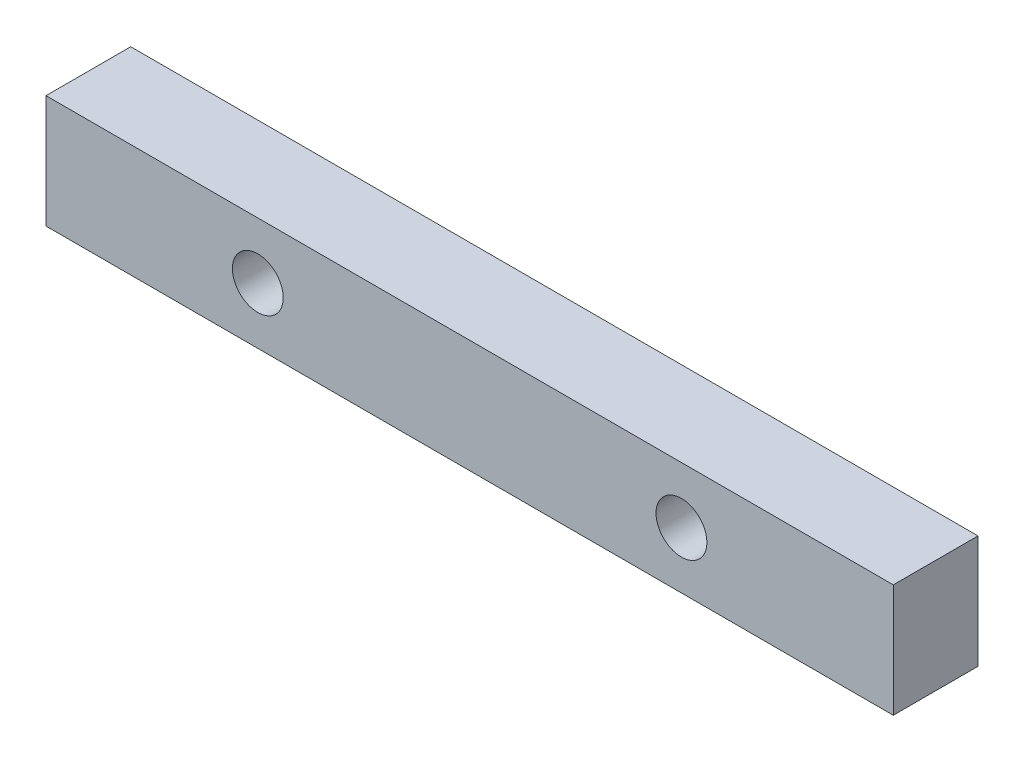
ISO-10303-21;
HEADER;
FILE_DESCRIPTION(('STEP AP214'),'2;1');
FILE_NAME('part.step','',(''),(''),'','','');
FILE_SCHEMA(('AUTOMOTIVE_DESIGN { 1 0 10303 214 1 1 1 1 }'));
ENDSEC;
DATA;
#1=APPLICATION_CONTEXT('core data for automotive mechanical design processes');
#2=APPLICATION_PROTOCOL_DEFINITION('international standard','automotive_design',2000,#1);
#3=PRODUCT_CONTEXT('',#1,'mechanical');
#4=PRODUCT('Part','Part','',(#3));
#5=PRODUCT_RELATED_PRODUCT_CATEGORY('part','',(#4));
#6=PRODUCT_DEFINITION_FORMATION('','',#4);
#7=PRODUCT_DEFINITION_CONTEXT('part definition',#1,'design');
#8=PRODUCT_DEFINITION('design','',#6,#7);
#9=PRODUCT_DEFINITION_SHAPE('','',#8);
#10=(LENGTH_UNIT() NAMED_UNIT(*) SI_UNIT(.MILLI.,.METRE.));
#11=(NAMED_UNIT(*) PLANE_ANGLE_UNIT() SI_UNIT($,.RADIAN.));
#12=(NAMED_UNIT(*) SI_UNIT($,.STERADIAN.) SOLID_ANGLE_UNIT());
#13=UNCERTAINTY_MEASURE_WITH_UNIT(LENGTH_MEASURE(1.E-05),#10,'distance_accuracy_value','');
#14=(GEOMETRIC_REPRESENTATION_CONTEXT(3) GLOBAL_UNCERTAINTY_ASSIGNED_CONTEXT((#13)) GLOBAL_UNIT_ASSIGNED_CONTEXT((#10,
#11,#12)) REPRESENTATION_CONTEXT('',''));
#15=CARTESIAN_POINT('',(0.,0.,0.));
#16=DIRECTION('',(0.,0.,1.));
#17=DIRECTION('',(1.,0.,0.));
#18=AXIS2_PLACEMENT_3D('',#15,#16,#17);
#19=CARTESIAN_POINT('',(75.,-10.,15.));
#20=DIRECTION('',(-1.,0.,0.));
#21=DIRECTION('',(0.,0.,1.));
#22=AXIS2_PLACEMENT_3D('',#19,#20,#21);
#23=PLANE('',#22);
#24=DIRECTION('',(0.,1.,0.));
#25=VECTOR('',#24,1.);
#26=CARTESIAN_POINT('',(75.,-10.,0.));
#27=LINE('',#26,#25);
#28=CARTESIAN_POINT('',(75.,-10.,0.));
#29=VERTEX_POINT('',#28);
#30=CARTESIAN_POINT('',(75.,10.,0.));
#31=VERTEX_POINT('',#30);
#32=EDGE_CURVE('E95',#29,#31,#27,.T.);
#33=ORIENTED_EDGE('',*,*,#32,.T.);
#34=DIRECTION('',(0.,0.,-1.));
#35=VECTOR('',#34,1.);
#36=CARTESIAN_POINT('',(75.,10.,15.));
#37=LINE('',#36,#35);
#38=CARTESIAN_POINT('',(75.,10.,15.));
#39=VERTEX_POINT('',#38);
#40=EDGE_CURVE('E11',#39,#31,#37,.T.);
#41=ORIENTED_EDGE('',*,*,#40,.F.);
#42=DIRECTION('',(0.,1.,0.));
#43=VECTOR('',#42,1.);
#44=CARTESIAN_POINT('',(75.,-10.,15.));
#45=LINE('',#44,#43);
#46=CARTESIAN_POINT('',(75.,-10.,15.));
#47=VERTEX_POINT('',#46);
#48=EDGE_CURVE('E83',#47,#39,#45,.T.);
#49=ORIENTED_EDGE('',*,*,#48,.F.);
#50=DIRECTION('',(0.,0.,-1.));
#51=VECTOR('',#50,1.);
#52=CARTESIAN_POINT('',(75.,-10.,15.));
#53=LINE('',#52,#51);
#54=EDGE_CURVE('E91',#47,#29,#53,.T.);
#55=ORIENTED_EDGE('',*,*,#54,.T.);
#56=EDGE_LOOP('',(#33,#41,#49,#55));
#57=FACE_BOUND('',#56,.T.);
#58=ADVANCED_FACE('F32',(#57),#23,.F.);
#59=CARTESIAN_POINT('',(-75.,10.,15.));
#60=DIRECTION('',(0.,-1.,0.));
#61=DIRECTION('',(0.,0.,-1.));
#62=AXIS2_PLACEMENT_3D('',#59,#60,#61);
#63=PLANE('',#62);
#64=DIRECTION('',(-1.,0.,0.));
#65=VECTOR('',#64,1.);
#66=CARTESIAN_POINT('',(-75.,10.,0.));
#67=LINE('',#66,#65);
#68=CARTESIAN_POINT('',(-75.,10.,0.));
#69=VERTEX_POINT('',#68);
#70=EDGE_CURVE('E87',#31,#69,#67,.T.);
#71=ORIENTED_EDGE('',*,*,#70,.T.);
#72=DIRECTION('',(0.,0.,-1.));
#73=VECTOR('',#72,1.);
#74=CARTESIAN_POINT('',(-75.,10.,15.));
#75=LINE('',#74,#73);
#76=CARTESIAN_POINT('',(-75.,10.,15.));
#77=VERTEX_POINT('',#76);
#78=EDGE_CURVE('E40',#77,#69,#75,.T.);
#79=ORIENTED_EDGE('',*,*,#78,.F.);
#80=DIRECTION('',(-1.,0.,0.));
#81=VECTOR('',#80,1.);
#82=CARTESIAN_POINT('',(-75.,10.,15.));
#83=LINE('',#82,#81);
#84=EDGE_CURVE('E78',#39,#77,#83,.T.);
#85=ORIENTED_EDGE('',*,*,#84,.F.);
#86=ORIENTED_EDGE('',*,*,#40,.T.);
#87=EDGE_LOOP('',(#71,#79,#85,#86));
#88=FACE_BOUND('',#87,.T.);
#89=ADVANCED_FACE('F86',(#88),#63,.F.);
#90=CARTESIAN_POINT('',(-75.,-10.,15.));
#91=DIRECTION('',(1.,0.,0.));
#92=DIRECTION('',(0.,0.,-1.));
#93=AXIS2_PLACEMENT_3D('',#90,#91,#92);
#94=PLANE('',#93);
#95=DIRECTION('',(0.,-1.,0.));
#96=VECTOR('',#95,1.);
#97=CARTESIAN_POINT('',(-75.,-10.,0.));
#98=LINE('',#97,#96);
#99=CARTESIAN_POINT('',(-75.,-10.,0.));
#100=VERTEX_POINT('',#99);
#101=EDGE_CURVE('E65',#69,#100,#98,.T.);
#102=ORIENTED_EDGE('',*,*,#101,.T.);
#103=DIRECTION('',(0.,0.,-1.));
#104=VECTOR('',#103,1.);
#105=CARTESIAN_POINT('',(-75.,-10.,15.));
#106=LINE('',#105,#104);
#107=CARTESIAN_POINT('',(-75.,-10.,15.));
#108=VERTEX_POINT('',#107);
#109=EDGE_CURVE('E88',#108,#100,#106,.T.);
#110=ORIENTED_EDGE('',*,*,#109,.F.);
#111=DIRECTION('',(0.,-1.,0.));
#112=VECTOR('',#111,1.);
#113=CARTESIAN_POINT('',(-75.,-10.,15.));
#114=LINE('',#113,#112);
#115=EDGE_CURVE('E81',#77,#108,#114,.T.);
#116=ORIENTED_EDGE('',*,*,#115,.F.);
#117=ORIENTED_EDGE('',*,*,#78,.T.);
#118=EDGE_LOOP('',(#102,#110,#116,#117));
#119=FACE_BOUND('',#118,.T.);
#120=ADVANCED_FACE('F89',(#119),#94,.F.);
#121=CARTESIAN_POINT('',(-75.,-10.,15.));
#122=DIRECTION('',(0.,1.,0.));
#123=DIRECTION('',(0.,0.,1.));
#124=AXIS2_PLACEMENT_3D('',#121,#122,#123);
#125=PLANE('',#124);
#126=DIRECTION('',(1.,0.,0.));
#127=VECTOR('',#126,1.);
#128=CARTESIAN_POINT('',(-75.,-10.,0.));
#129=LINE('',#128,#127);
#130=EDGE_CURVE('E71',#100,#29,#129,.T.);
#131=ORIENTED_EDGE('',*,*,#130,.T.);
#132=ORIENTED_EDGE('',*,*,#54,.F.);
#133=DIRECTION('',(1.,0.,0.));
#134=VECTOR('',#133,1.);
#135=CARTESIAN_POINT('',(-75.,-10.,15.));
#136=LINE('',#135,#134);
#137=EDGE_CURVE('E48',#108,#47,#136,.T.);
#138=ORIENTED_EDGE('',*,*,#137,.F.);
#139=ORIENTED_EDGE('',*,*,#109,.T.);
#140=EDGE_LOOP('',(#131,#132,#138,#139));
#141=FACE_BOUND('',#140,.T.);
#142=ADVANCED_FACE('F103',(#141),#125,.F.);
#143=CARTESIAN_POINT('',(0.,0.,15.));
#144=DIRECTION('',(0.,0.,-1.));
#145=DIRECTION('',(-1.,0.,0.));
#146=AXIS2_PLACEMENT_3D('',#143,#144,#145);
#147=PLANE('',#146);
#148=CARTESIAN_POINT('',(37.5,0.,15.));
#149=DIRECTION('',(0.,0.,-1.));
#150=DIRECTION('',(-1.,0.,0.));
#151=AXIS2_PLACEMENT_3D('',#148,#149,#150);
#152=CIRCLE('',#151,4.5);
#153=CARTESIAN_POINT('',(33.,0.,15.));
#154=VERTEX_POINT('',#153);
#155=EDGE_CURVE('E117',#154,#154,#152,.T.);
#156=ORIENTED_EDGE('',*,*,#155,.T.);
#157=EDGE_LOOP('',(#156));
#158=FACE_BOUND('',#157,.T.);
#159=CARTESIAN_POINT('',(-37.5,0.,15.));
#160=DIRECTION('',(0.,0.,-1.));
#161=DIRECTION('',(-1.,0.,0.));
#162=AXIS2_PLACEMENT_3D('',#159,#160,#161);
#163=CIRCLE('',#162,4.5);
#164=CARTESIAN_POINT('',(-42.,0.,15.));
#165=VERTEX_POINT('',#164);
#166=EDGE_CURVE('E98',#165,#165,#163,.T.);
#167=ORIENTED_EDGE('',*,*,#166,.T.);
#168=EDGE_LOOP('',(#167));
#169=FACE_BOUND('',#168,.T.);
#170=ORIENTED_EDGE('',*,*,#48,.T.);
#171=ORIENTED_EDGE('',*,*,#84,.T.);
#172=ORIENTED_EDGE('',*,*,#115,.T.);
#173=ORIENTED_EDGE('',*,*,#137,.T.);
#174=EDGE_LOOP('',(#170,#171,#172,#173));
#175=FACE_BOUND('',#174,.T.);
#176=ADVANCED_FACE('F79',(#158,#169,#175),#147,.F.);
#177=CARTESIAN_POINT('',(0.,0.,0.));
#178=DIRECTION('',(0.,0.,-1.));
#179=DIRECTION('',(-1.,0.,0.));
#180=AXIS2_PLACEMENT_3D('',#177,#178,#179);
#181=PLANE('',#180);
#182=CARTESIAN_POINT('',(37.5,0.,0.));
#183=DIRECTION('',(0.,0.,-1.));
#184=DIRECTION('',(-1.,0.,0.));
#185=AXIS2_PLACEMENT_3D('',#182,#183,#184);
#186=CIRCLE('',#185,8.96);
#187=CARTESIAN_POINT('',(28.54,0.,0.));
#188=VERTEX_POINT('',#187);
#189=EDGE_CURVE('E123',#188,#188,#186,.T.);
#190=ORIENTED_EDGE('',*,*,#189,.F.);
#191=EDGE_LOOP('',(#190));
#192=FACE_BOUND('',#191,.T.);
#193=CARTESIAN_POINT('',(-37.5,0.,0.));
#194=DIRECTION('',(0.,0.,-1.));
#195=DIRECTION('',(-1.,0.,0.));
#196=AXIS2_PLACEMENT_3D('',#193,#194,#195);
#197=CIRCLE('',#196,8.96);
#198=CARTESIAN_POINT('',(-46.46,0.,0.));
#199=VERTEX_POINT('',#198);
#200=EDGE_CURVE('E114',#199,#199,#197,.T.);
#201=ORIENTED_EDGE('',*,*,#200,.F.);
#202=EDGE_LOOP('',(#201));
#203=FACE_BOUND('',#202,.T.);
#204=ORIENTED_EDGE('',*,*,#32,.F.);
#205=ORIENTED_EDGE('',*,*,#130,.F.);
#206=ORIENTED_EDGE('',*,*,#101,.F.);
#207=ORIENTED_EDGE('',*,*,#70,.F.);
#208=EDGE_LOOP('',(#204,#205,#206,#207));
#209=FACE_BOUND('',#208,.T.);
#210=ADVANCED_FACE('F106',(#192,#203,#209),#181,.T.);
#211=CARTESIAN_POINT('',(-37.5,0.,0.));
#212=DIRECTION('',(0.,0.,-1.));
#213=DIRECTION('',(-1.,0.,0.));
#214=AXIS2_PLACEMENT_3D('',#211,#212,#213);
#215=CYLINDRICAL_SURFACE('',#214,4.5);
#216=ORIENTED_EDGE('',*,*,#166,.F.);
#217=EDGE_LOOP('',(#216));
#218=FACE_BOUND('',#217,.T.);
#219=CARTESIAN_POINT('',(-37.5,0.,4.46));
#220=DIRECTION('',(0.,0.,-1.));
#221=DIRECTION('',(-1.,0.,0.));
#222=AXIS2_PLACEMENT_3D('',#219,#220,#221);
#223=CIRCLE('',#222,4.5);
#224=CARTESIAN_POINT('',(-42.,0.,4.46));
#225=VERTEX_POINT('',#224);
#226=EDGE_CURVE('E111',#225,#225,#223,.T.);
#227=ORIENTED_EDGE('',*,*,#226,.T.);
#228=EDGE_LOOP('',(#227));
#229=FACE_BOUND('',#228,.T.);
#230=ADVANCED_FACE('F131',(#218,#229),#215,.F.);
#231=CARTESIAN_POINT('',(-37.5,0.,0.));
#232=DIRECTION('',(0.,0.,-1.));
#233=DIRECTION('',(-1.,0.,0.));
#234=AXIS2_PLACEMENT_3D('',#231,#232,#233);
#235=CONICAL_SURFACE('',#234,8.96,0.785398163397449);
#236=ORIENTED_EDGE('',*,*,#226,.F.);
#237=EDGE_LOOP('',(#236));
#238=FACE_BOUND('',#237,.T.);
#239=ORIENTED_EDGE('',*,*,#200,.T.);
#240=EDGE_LOOP('',(#239));
#241=FACE_BOUND('',#240,.T.);
#242=ADVANCED_FACE('F135',(#238,#241),#235,.F.);
#243=CARTESIAN_POINT('',(37.5,0.,0.));
#244=DIRECTION('',(0.,0.,-1.));
#245=DIRECTION('',(-1.,0.,0.));
#246=AXIS2_PLACEMENT_3D('',#243,#244,#245);
#247=CYLINDRICAL_SURFACE('',#246,4.5);
#248=ORIENTED_EDGE('',*,*,#155,.F.);
#249=EDGE_LOOP('',(#248));
#250=FACE_BOUND('',#249,.T.);
#251=CARTESIAN_POINT('',(37.5,0.,4.46));
#252=DIRECTION('',(0.,0.,-1.));
#253=DIRECTION('',(-1.,0.,0.));
#254=AXIS2_PLACEMENT_3D('',#251,#252,#253);
#255=CIRCLE('',#254,4.5);
#256=CARTESIAN_POINT('',(33.,0.,4.46));
#257=VERTEX_POINT('',#256);
#258=EDGE_CURVE('E120',#257,#257,#255,.T.);
#259=ORIENTED_EDGE('',*,*,#258,.T.);
#260=EDGE_LOOP('',(#259));
#261=FACE_BOUND('',#260,.T.);
#262=ADVANCED_FACE('F137',(#250,#261),#247,.F.);
#263=CARTESIAN_POINT('',(37.5,0.,0.));
#264=DIRECTION('',(0.,0.,-1.));
#265=DIRECTION('',(-1.,0.,0.));
#266=AXIS2_PLACEMENT_3D('',#263,#264,#265);
#267=CONICAL_SURFACE('',#266,8.96,0.785398163397449);
#268=ORIENTED_EDGE('',*,*,#258,.F.);
#269=EDGE_LOOP('',(#268));
#270=FACE_BOUND('',#269,.T.);
#271=ORIENTED_EDGE('',*,*,#189,.T.);
#272=EDGE_LOOP('',(#271));
#273=FACE_BOUND('',#272,.T.);
#274=ADVANCED_FACE('F127',(#270,#273),#267,.F.);
#275=CLOSED_SHELL('',(#58,#89,#120,#142,#176,#210,#230,#242,#262,#274));
#276=MANIFOLD_SOLID_BREP('B2',#275);
#277=ADVANCED_BREP_SHAPE_REPRESENTATION('',(#18,#276),#14);
#278=SHAPE_DEFINITION_REPRESENTATION(#9,#277);
ENDSEC;
END-ISO-10303-21;
